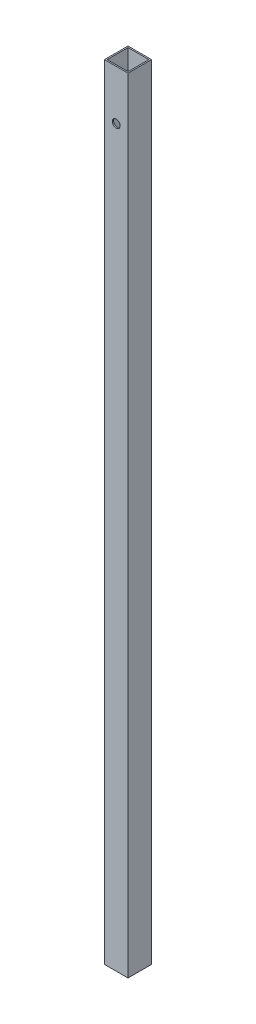
ISO-10303-21;
HEADER;
FILE_DESCRIPTION(('STEP AP214'),'2;1');
FILE_NAME('part.step','',(''),(''),'','','');
FILE_SCHEMA(('AUTOMOTIVE_DESIGN { 1 0 10303 214 1 1 1 1 }'));
ENDSEC;
DATA;
#1=APPLICATION_CONTEXT('core data for automotive mechanical design processes');
#2=APPLICATION_PROTOCOL_DEFINITION('international standard','automotive_design',2000,#1);
#3=PRODUCT_CONTEXT('',#1,'mechanical');
#4=PRODUCT('Part','Part','',(#3));
#5=PRODUCT_RELATED_PRODUCT_CATEGORY('part','',(#4));
#6=PRODUCT_DEFINITION_FORMATION('','',#4);
#7=PRODUCT_DEFINITION_CONTEXT('part definition',#1,'design');
#8=PRODUCT_DEFINITION('design','',#6,#7);
#9=PRODUCT_DEFINITION_SHAPE('','',#8);
#10=(LENGTH_UNIT() NAMED_UNIT(*) SI_UNIT(.MILLI.,.METRE.));
#11=(NAMED_UNIT(*) PLANE_ANGLE_UNIT() SI_UNIT($,.RADIAN.));
#12=(NAMED_UNIT(*) SI_UNIT($,.STERADIAN.) SOLID_ANGLE_UNIT());
#13=UNCERTAINTY_MEASURE_WITH_UNIT(LENGTH_MEASURE(1.E-05),#10,'distance_accuracy_value','');
#14=(GEOMETRIC_REPRESENTATION_CONTEXT(3) GLOBAL_UNCERTAINTY_ASSIGNED_CONTEXT((#13)) GLOBAL_UNIT_ASSIGNED_CONTEXT((#10,
#11,#12)) REPRESENTATION_CONTEXT('',''));
#15=CARTESIAN_POINT('',(0.,0.,0.));
#16=DIRECTION('',(0.,0.,1.));
#17=DIRECTION('',(1.,0.,0.));
#18=AXIS2_PLACEMENT_3D('',#15,#16,#17);
#19=CARTESIAN_POINT('',(0.,600.,0.));
#20=DIRECTION('',(0.,1.,0.));
#21=DIRECTION('',(0.,0.,1.));
#22=AXIS2_PLACEMENT_3D('',#19,#20,#21);
#23=PLANE('',#22);
#24=DIRECTION('',(0.,0.,-1.));
#25=VECTOR('',#24,1.);
#26=CARTESIAN_POINT('',(9.00000000000001,600.,-9.));
#27=LINE('',#26,#25);
#28=CARTESIAN_POINT('',(9.00000000000001,600.,9.00000000000001));
#29=VERTEX_POINT('',#28);
#30=CARTESIAN_POINT('',(9.00000000000001,600.,-9.));
#31=VERTEX_POINT('',#30);
#32=EDGE_CURVE('E145',#29,#31,#27,.T.);
#33=ORIENTED_EDGE('',*,*,#32,.T.);
#34=DIRECTION('',(-1.,0.,0.));
#35=VECTOR('',#34,1.);
#36=CARTESIAN_POINT('',(-9.,600.,-9.));
#37=LINE('',#36,#35);
#38=CARTESIAN_POINT('',(-9.,600.,-9.));
#39=VERTEX_POINT('',#38);
#40=EDGE_CURVE('E148',#31,#39,#37,.T.);
#41=ORIENTED_EDGE('',*,*,#40,.T.);
#42=DIRECTION('',(0.,0.,1.));
#43=VECTOR('',#42,1.);
#44=CARTESIAN_POINT('',(-9.,600.,-9.));
#45=LINE('',#44,#43);
#46=CARTESIAN_POINT('',(-8.99999999999999,600.,9.00000000000001));
#47=VERTEX_POINT('',#46);
#48=EDGE_CURVE('E151',#39,#47,#45,.T.);
#49=ORIENTED_EDGE('',*,*,#48,.T.);
#50=DIRECTION('',(1.,0.,0.));
#51=VECTOR('',#50,1.);
#52=CARTESIAN_POINT('',(-8.99999999999999,600.,9.00000000000001));
#53=LINE('',#52,#51);
#54=EDGE_CURVE('E153',#47,#29,#53,.T.);
#55=ORIENTED_EDGE('',*,*,#54,.T.);
#56=EDGE_LOOP('',(#33,#41,#49,#55));
#57=FACE_BOUND('',#56,.T.);
#58=DIRECTION('',(0.,0.,1.));
#59=VECTOR('',#58,1.);
#60=CARTESIAN_POINT('',(-8.,600.,-8.));
#61=LINE('',#60,#59);
#62=CARTESIAN_POINT('',(-8.,600.,-8.));
#63=VERTEX_POINT('',#62);
#64=CARTESIAN_POINT('',(-7.99999999999999,600.,8.00000000000001));
#65=VERTEX_POINT('',#64);
#66=EDGE_CURVE('E115',#63,#65,#61,.T.);
#67=ORIENTED_EDGE('',*,*,#66,.F.);
#68=DIRECTION('',(-1.,0.,0.));
#69=VECTOR('',#68,1.);
#70=CARTESIAN_POINT('',(-8.,600.,-8.));
#71=LINE('',#70,#69);
#72=CARTESIAN_POINT('',(8.,600.,-8.));
#73=VERTEX_POINT('',#72);
#74=EDGE_CURVE('E107',#73,#63,#71,.T.);
#75=ORIENTED_EDGE('',*,*,#74,.F.);
#76=DIRECTION('',(0.,0.,-1.));
#77=VECTOR('',#76,1.);
#78=CARTESIAN_POINT('',(8.,600.,-8.));
#79=LINE('',#78,#77);
#80=CARTESIAN_POINT('',(8.00000000000001,600.,8.00000000000001));
#81=VERTEX_POINT('',#80);
#82=EDGE_CURVE('E129',#81,#73,#79,.T.);
#83=ORIENTED_EDGE('',*,*,#82,.F.);
#84=DIRECTION('',(1.,0.,0.));
#85=VECTOR('',#84,1.);
#86=CARTESIAN_POINT('',(-7.99999999999999,600.,8.00000000000001));
#87=LINE('',#86,#85);
#88=EDGE_CURVE('E127',#65,#81,#87,.T.);
#89=ORIENTED_EDGE('',*,*,#88,.F.);
#90=EDGE_LOOP('',(#67,#75,#83,#89));
#91=FACE_BOUND('',#90,.T.);
#92=ADVANCED_FACE('F41',(#57,#91),#23,.T.);
#93=CARTESIAN_POINT('',(0.,0.,0.));
#94=DIRECTION('',(0.,1.,0.));
#95=DIRECTION('',(0.,0.,1.));
#96=AXIS2_PLACEMENT_3D('',#93,#94,#95);
#97=PLANE('',#96);
#98=DIRECTION('',(0.,0.,-1.));
#99=VECTOR('',#98,1.);
#100=CARTESIAN_POINT('',(9.00000000000001,0.,-9.));
#101=LINE('',#100,#99);
#102=CARTESIAN_POINT('',(9.00000000000001,0.,9.00000000000001));
#103=VERTEX_POINT('',#102);
#104=CARTESIAN_POINT('',(9.00000000000001,0.,-9.));
#105=VERTEX_POINT('',#104);
#106=EDGE_CURVE('E123',#103,#105,#101,.T.);
#107=ORIENTED_EDGE('',*,*,#106,.F.);
#108=DIRECTION('',(1.,0.,0.));
#109=VECTOR('',#108,1.);
#110=CARTESIAN_POINT('',(-8.99999999999999,0.,9.00000000000001));
#111=LINE('',#110,#109);
#112=CARTESIAN_POINT('',(-8.99999999999999,0.,9.00000000000001));
#113=VERTEX_POINT('',#112);
#114=EDGE_CURVE('E149',#113,#103,#111,.T.);
#115=ORIENTED_EDGE('',*,*,#114,.F.);
#116=DIRECTION('',(0.,0.,1.));
#117=VECTOR('',#116,1.);
#118=CARTESIAN_POINT('',(-9.,0.,-9.));
#119=LINE('',#118,#117);
#120=CARTESIAN_POINT('',(-9.,0.,-9.));
#121=VERTEX_POINT('',#120);
#122=EDGE_CURVE('E160',#121,#113,#119,.T.);
#123=ORIENTED_EDGE('',*,*,#122,.F.);
#124=DIRECTION('',(-1.,0.,0.));
#125=VECTOR('',#124,1.);
#126=CARTESIAN_POINT('',(-9.,0.,-9.));
#127=LINE('',#126,#125);
#128=EDGE_CURVE('E158',#105,#121,#127,.T.);
#129=ORIENTED_EDGE('',*,*,#128,.F.);
#130=EDGE_LOOP('',(#107,#115,#123,#129));
#131=FACE_BOUND('',#130,.T.);
#132=DIRECTION('',(-1.,0.,0.));
#133=VECTOR('',#132,1.);
#134=CARTESIAN_POINT('',(-8.,0.,-8.));
#135=LINE('',#134,#133);
#136=CARTESIAN_POINT('',(8.,0.,-8.));
#137=VERTEX_POINT('',#136);
#138=CARTESIAN_POINT('',(-8.,0.,-8.));
#139=VERTEX_POINT('',#138);
#140=EDGE_CURVE('E65',#137,#139,#135,.T.);
#141=ORIENTED_EDGE('',*,*,#140,.T.);
#142=DIRECTION('',(0.,0.,1.));
#143=VECTOR('',#142,1.);
#144=CARTESIAN_POINT('',(-8.,0.,-8.));
#145=LINE('',#144,#143);
#146=CARTESIAN_POINT('',(-7.99999999999999,0.,8.00000000000001));
#147=VERTEX_POINT('',#146);
#148=EDGE_CURVE('E122',#139,#147,#145,.T.);
#149=ORIENTED_EDGE('',*,*,#148,.T.);
#150=DIRECTION('',(1.,0.,0.));
#151=VECTOR('',#150,1.);
#152=CARTESIAN_POINT('',(-7.99999999999999,0.,8.00000000000001));
#153=LINE('',#152,#151);
#154=CARTESIAN_POINT('',(8.00000000000001,0.,8.00000000000001));
#155=VERTEX_POINT('',#154);
#156=EDGE_CURVE('E137',#147,#155,#153,.T.);
#157=ORIENTED_EDGE('',*,*,#156,.T.);
#158=DIRECTION('',(0.,0.,-1.));
#159=VECTOR('',#158,1.);
#160=CARTESIAN_POINT('',(8.,0.,-8.));
#161=LINE('',#160,#159);
#162=EDGE_CURVE('E116',#155,#137,#161,.T.);
#163=ORIENTED_EDGE('',*,*,#162,.T.);
#164=EDGE_LOOP('',(#141,#149,#157,#163));
#165=FACE_BOUND('',#164,.T.);
#166=ADVANCED_FACE('F179',(#131,#165),#97,.F.);
#167=CARTESIAN_POINT('',(9.00000000000001,600.,-9.));
#168=DIRECTION('',(-1.,0.,0.));
#169=DIRECTION('',(0.,0.,1.));
#170=AXIS2_PLACEMENT_3D('',#167,#168,#169);
#171=PLANE('',#170);
#172=ORIENTED_EDGE('',*,*,#106,.T.);
#173=DIRECTION('',(0.,-1.,0.));
#174=VECTOR('',#173,1.);
#175=CARTESIAN_POINT('',(9.00000000000001,600.,-9.));
#176=LINE('',#175,#174);
#177=EDGE_CURVE('E11',#31,#105,#176,.T.);
#178=ORIENTED_EDGE('',*,*,#177,.F.);
#179=ORIENTED_EDGE('',*,*,#32,.F.);
#180=DIRECTION('',(0.,-1.,0.));
#181=VECTOR('',#180,1.);
#182=CARTESIAN_POINT('',(9.00000000000001,600.,9.00000000000001));
#183=LINE('',#182,#181);
#184=EDGE_CURVE('E155',#29,#103,#183,.T.);
#185=ORIENTED_EDGE('',*,*,#184,.T.);
#186=EDGE_LOOP('',(#172,#178,#179,#185));
#187=FACE_BOUND('',#186,.T.);
#188=ADVANCED_FACE('F43',(#187),#171,.F.);
#189=CARTESIAN_POINT('',(-9.,600.,-9.));
#190=DIRECTION('',(0.,0.,1.));
#191=DIRECTION('',(1.,0.,0.));
#192=AXIS2_PLACEMENT_3D('',#189,#190,#191);
#193=PLANE('',#192);
#194=CARTESIAN_POINT('',(0.,562.,-9.00000000000001));
#195=DIRECTION('',(0.,0.,1.));
#196=DIRECTION('',(1.,0.,0.));
#197=AXIS2_PLACEMENT_3D('',#194,#195,#196);
#198=CIRCLE('',#197,3.);
#199=CARTESIAN_POINT('',(3.,562.,-9.00000000000001));
#200=VERTEX_POINT('',#199);
#201=EDGE_CURVE('E135',#200,#200,#198,.T.);
#202=ORIENTED_EDGE('',*,*,#201,.T.);
#203=EDGE_LOOP('',(#202));
#204=FACE_BOUND('',#203,.T.);
#205=ORIENTED_EDGE('',*,*,#128,.T.);
#206=DIRECTION('',(0.,-1.,0.));
#207=VECTOR('',#206,1.);
#208=CARTESIAN_POINT('',(-9.,600.,-9.));
#209=LINE('',#208,#207);
#210=EDGE_CURVE('E50',#39,#121,#209,.T.);
#211=ORIENTED_EDGE('',*,*,#210,.F.);
#212=ORIENTED_EDGE('',*,*,#40,.F.);
#213=ORIENTED_EDGE('',*,*,#177,.T.);
#214=EDGE_LOOP('',(#205,#211,#212,#213));
#215=FACE_BOUND('',#214,.T.);
#216=ADVANCED_FACE('F189',(#204,#215),#193,.F.);
#217=CARTESIAN_POINT('',(-9.,600.,-9.));
#218=DIRECTION('',(1.,0.,0.));
#219=DIRECTION('',(0.,0.,-1.));
#220=AXIS2_PLACEMENT_3D('',#217,#218,#219);
#221=PLANE('',#220);
#222=ORIENTED_EDGE('',*,*,#122,.T.);
#223=DIRECTION('',(0.,-1.,0.));
#224=VECTOR('',#223,1.);
#225=CARTESIAN_POINT('',(-8.99999999999999,600.,9.00000000000001));
#226=LINE('',#225,#224);
#227=EDGE_CURVE('E165',#47,#113,#226,.T.);
#228=ORIENTED_EDGE('',*,*,#227,.F.);
#229=ORIENTED_EDGE('',*,*,#48,.F.);
#230=ORIENTED_EDGE('',*,*,#210,.T.);
#231=EDGE_LOOP('',(#222,#228,#229,#230));
#232=FACE_BOUND('',#231,.T.);
#233=ADVANCED_FACE('F173',(#232),#221,.F.);
#234=CARTESIAN_POINT('',(-8.99999999999999,600.,9.00000000000001));
#235=DIRECTION('',(0.,0.,-1.));
#236=DIRECTION('',(-1.,0.,0.));
#237=AXIS2_PLACEMENT_3D('',#234,#235,#236);
#238=PLANE('',#237);
#239=CARTESIAN_POINT('',(0.,562.,9.00000000000001));
#240=DIRECTION('',(0.,0.,1.));
#241=DIRECTION('',(1.,0.,0.));
#242=AXIS2_PLACEMENT_3D('',#239,#240,#241);
#243=CIRCLE('',#242,3.);
#244=CARTESIAN_POINT('',(3.,562.,9.00000000000001));
#245=VERTEX_POINT('',#244);
#246=EDGE_CURVE('E216',#245,#245,#243,.T.);
#247=ORIENTED_EDGE('',*,*,#246,.F.);
#248=EDGE_LOOP('',(#247));
#249=FACE_BOUND('',#248,.T.);
#250=ORIENTED_EDGE('',*,*,#114,.T.);
#251=ORIENTED_EDGE('',*,*,#184,.F.);
#252=ORIENTED_EDGE('',*,*,#54,.F.);
#253=ORIENTED_EDGE('',*,*,#227,.T.);
#254=EDGE_LOOP('',(#250,#251,#252,#253));
#255=FACE_BOUND('',#254,.T.);
#256=ADVANCED_FACE('F183',(#249,#255),#238,.F.);
#257=CARTESIAN_POINT('',(-8.,600.,-8.));
#258=DIRECTION('',(0.,0.,1.));
#259=DIRECTION('',(1.,0.,0.));
#260=AXIS2_PLACEMENT_3D('',#257,#258,#259);
#261=PLANE('',#260);
#262=CARTESIAN_POINT('',(0.,562.,-8.00000000000001));
#263=DIRECTION('',(0.,0.,1.));
#264=DIRECTION('',(1.,0.,0.));
#265=AXIS2_PLACEMENT_3D('',#262,#263,#264);
#266=CIRCLE('',#265,3.);
#267=CARTESIAN_POINT('',(3.,562.,-8.00000000000001));
#268=VERTEX_POINT('',#267);
#269=EDGE_CURVE('E220',#268,#268,#266,.T.);
#270=ORIENTED_EDGE('',*,*,#269,.F.);
#271=EDGE_LOOP('',(#270));
#272=FACE_BOUND('',#271,.T.);
#273=ORIENTED_EDGE('',*,*,#140,.F.);
#274=DIRECTION('',(0.,-1.,0.));
#275=VECTOR('',#274,1.);
#276=CARTESIAN_POINT('',(8.,600.,-8.));
#277=LINE('',#276,#275);
#278=EDGE_CURVE('E111',#73,#137,#277,.T.);
#279=ORIENTED_EDGE('',*,*,#278,.F.);
#280=ORIENTED_EDGE('',*,*,#74,.T.);
#281=DIRECTION('',(0.,-1.,0.));
#282=VECTOR('',#281,1.);
#283=CARTESIAN_POINT('',(-8.,600.,-8.));
#284=LINE('',#283,#282);
#285=EDGE_CURVE('E110',#63,#139,#284,.T.);
#286=ORIENTED_EDGE('',*,*,#285,.T.);
#287=EDGE_LOOP('',(#273,#279,#280,#286));
#288=FACE_BOUND('',#287,.T.);
#289=ADVANCED_FACE('F109',(#272,#288),#261,.T.);
#290=CARTESIAN_POINT('',(-8.,600.,-8.));
#291=DIRECTION('',(1.,0.,0.));
#292=DIRECTION('',(0.,0.,-1.));
#293=AXIS2_PLACEMENT_3D('',#290,#291,#292);
#294=PLANE('',#293);
#295=ORIENTED_EDGE('',*,*,#148,.F.);
#296=ORIENTED_EDGE('',*,*,#285,.F.);
#297=ORIENTED_EDGE('',*,*,#66,.T.);
#298=DIRECTION('',(0.,-1.,0.));
#299=VECTOR('',#298,1.);
#300=CARTESIAN_POINT('',(-7.99999999999999,600.,8.00000000000001));
#301=LINE('',#300,#299);
#302=EDGE_CURVE('E124',#65,#147,#301,.T.);
#303=ORIENTED_EDGE('',*,*,#302,.T.);
#304=EDGE_LOOP('',(#295,#296,#297,#303));
#305=FACE_BOUND('',#304,.T.);
#306=ADVANCED_FACE('F119',(#305),#294,.T.);
#307=CARTESIAN_POINT('',(-7.99999999999999,600.,8.00000000000001));
#308=DIRECTION('',(0.,0.,-1.));
#309=DIRECTION('',(-1.,0.,0.));
#310=AXIS2_PLACEMENT_3D('',#307,#308,#309);
#311=PLANE('',#310);
#312=CARTESIAN_POINT('',(0.,562.,8.00000000000001));
#313=DIRECTION('',(0.,0.,-1.));
#314=DIRECTION('',(-1.,0.,0.));
#315=AXIS2_PLACEMENT_3D('',#312,#313,#314);
#316=CIRCLE('',#315,3.);
#317=CARTESIAN_POINT('',(-3.,562.,8.00000000000001));
#318=VERTEX_POINT('',#317);
#319=EDGE_CURVE('E45',#318,#318,#316,.T.);
#320=ORIENTED_EDGE('',*,*,#319,.F.);
#321=EDGE_LOOP('',(#320));
#322=FACE_BOUND('',#321,.T.);
#323=ORIENTED_EDGE('',*,*,#156,.F.);
#324=ORIENTED_EDGE('',*,*,#302,.F.);
#325=ORIENTED_EDGE('',*,*,#88,.T.);
#326=DIRECTION('',(0.,-1.,0.));
#327=VECTOR('',#326,1.);
#328=CARTESIAN_POINT('',(8.00000000000001,600.,8.00000000000001));
#329=LINE('',#328,#327);
#330=EDGE_CURVE('E57',#81,#155,#329,.T.);
#331=ORIENTED_EDGE('',*,*,#330,.T.);
#332=EDGE_LOOP('',(#323,#324,#325,#331));
#333=FACE_BOUND('',#332,.T.);
#334=ADVANCED_FACE('F237',(#322,#333),#311,.T.);
#335=CARTESIAN_POINT('',(8.,600.,-8.));
#336=DIRECTION('',(-1.,0.,0.));
#337=DIRECTION('',(0.,0.,1.));
#338=AXIS2_PLACEMENT_3D('',#335,#336,#337);
#339=PLANE('',#338);
#340=ORIENTED_EDGE('',*,*,#162,.F.);
#341=ORIENTED_EDGE('',*,*,#330,.F.);
#342=ORIENTED_EDGE('',*,*,#82,.T.);
#343=ORIENTED_EDGE('',*,*,#278,.T.);
#344=EDGE_LOOP('',(#340,#341,#342,#343));
#345=FACE_BOUND('',#344,.T.);
#346=ADVANCED_FACE('F233',(#345),#339,.T.);
#347=CARTESIAN_POINT('',(0.,562.,-984.));
#348=DIRECTION('',(0.,0.,1.));
#349=DIRECTION('',(1.,0.,0.));
#350=AXIS2_PLACEMENT_3D('',#347,#348,#349);
#351=CYLINDRICAL_SURFACE('',#350,3.);
#352=ORIENTED_EDGE('',*,*,#319,.T.);
#353=EDGE_LOOP('',(#352));
#354=FACE_BOUND('',#353,.T.);
#355=ORIENTED_EDGE('',*,*,#246,.T.);
#356=EDGE_LOOP('',(#355));
#357=FACE_BOUND('',#356,.T.);
#358=ADVANCED_FACE('F227',(#354,#357),#351,.F.);
#359=ORIENTED_EDGE('',*,*,#269,.T.);
#360=EDGE_LOOP('',(#359));
#361=FACE_BOUND('',#360,.T.);
#362=ORIENTED_EDGE('',*,*,#201,.F.);
#363=EDGE_LOOP('',(#362));
#364=FACE_BOUND('',#363,.T.);
#365=ADVANCED_FACE('F225',(#361,#364),#351,.F.);
#366=CLOSED_SHELL('',(#92,#166,#188,#216,#233,#256,#289,#306,#334,#346,#358,#365));
#367=MANIFOLD_SOLID_BREP('B2',#366);
#368=ADVANCED_BREP_SHAPE_REPRESENTATION('',(#18,#367),#14);
#369=SHAPE_DEFINITION_REPRESENTATION(#9,#368);
ENDSEC;
END-ISO-10303-21;
